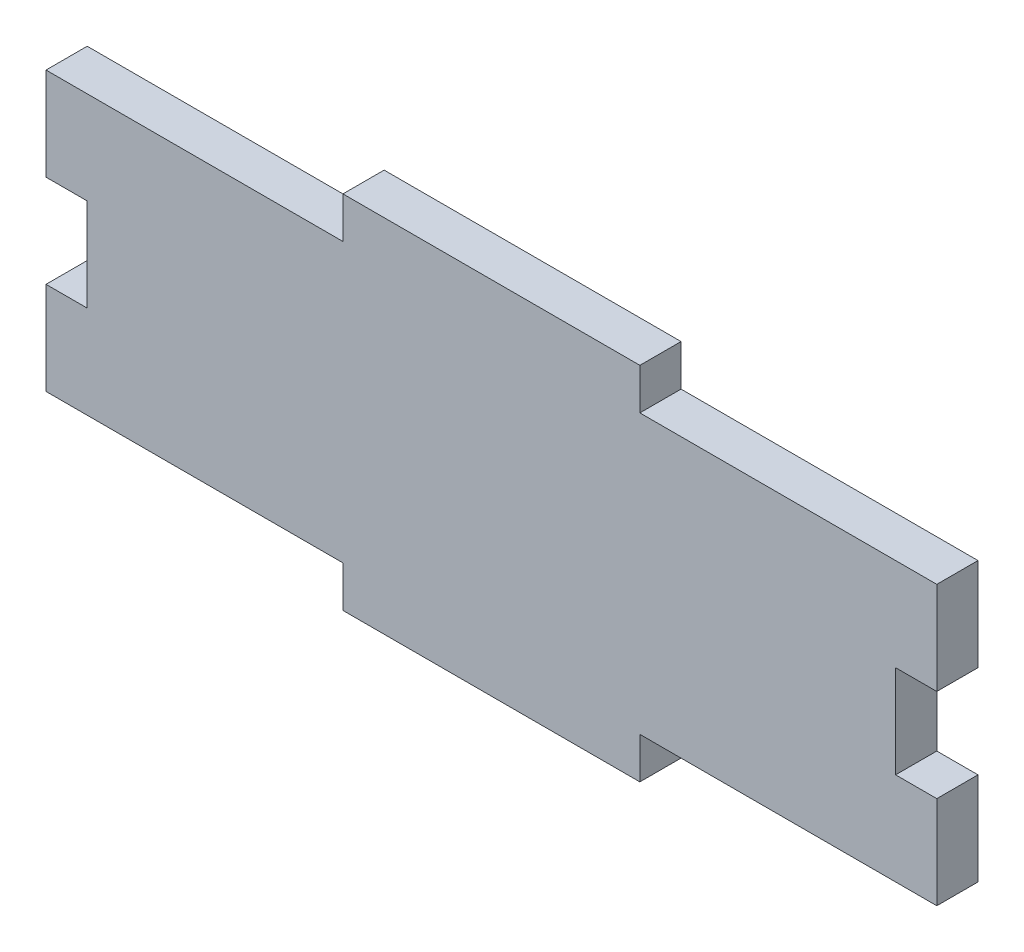
ISO-10303-21;
HEADER;
FILE_DESCRIPTION(('STEP AP214'),'2;1');
FILE_NAME('part.step','',(''),(''),'','','');
FILE_SCHEMA(('AUTOMOTIVE_DESIGN { 1 0 10303 214 1 1 1 1 }'));
ENDSEC;
DATA;
#1=APPLICATION_CONTEXT('core data for automotive mechanical design processes');
#2=APPLICATION_PROTOCOL_DEFINITION('international standard','automotive_design',2000,#1);
#3=PRODUCT_CONTEXT('',#1,'mechanical');
#4=PRODUCT('Part','Part','',(#3));
#5=PRODUCT_RELATED_PRODUCT_CATEGORY('part','',(#4));
#6=PRODUCT_DEFINITION_FORMATION('','',#4);
#7=PRODUCT_DEFINITION_CONTEXT('part definition',#1,'design');
#8=PRODUCT_DEFINITION('design','',#6,#7);
#9=PRODUCT_DEFINITION_SHAPE('','',#8);
#10=(LENGTH_UNIT() NAMED_UNIT(*) SI_UNIT(.MILLI.,.METRE.));
#11=(NAMED_UNIT(*) PLANE_ANGLE_UNIT() SI_UNIT($,.RADIAN.));
#12=(NAMED_UNIT(*) SI_UNIT($,.STERADIAN.) SOLID_ANGLE_UNIT());
#13=UNCERTAINTY_MEASURE_WITH_UNIT(LENGTH_MEASURE(1.E-05),#10,'distance_accuracy_value','');
#14=(GEOMETRIC_REPRESENTATION_CONTEXT(3) GLOBAL_UNCERTAINTY_ASSIGNED_CONTEXT((#13)) GLOBAL_UNIT_ASSIGNED_CONTEXT((#10,
#11,#12)) REPRESENTATION_CONTEXT('',''));
#15=CARTESIAN_POINT('',(0.,0.,0.));
#16=DIRECTION('',(0.,0.,1.));
#17=DIRECTION('',(1.,0.,0.));
#18=AXIS2_PLACEMENT_3D('',#15,#16,#17);
#19=CARTESIAN_POINT('',(0.,0.,4.699));
#20=DIRECTION('',(0.,0.,-1.));
#21=DIRECTION('',(-1.,0.,0.));
#22=AXIS2_PLACEMENT_3D('',#19,#20,#21);
#23=PLANE('',#22);
#24=DIRECTION('',(-1.,0.,0.));
#25=VECTOR('',#24,1.);
#26=CARTESIAN_POINT('',(101.6,21.1666666666667,4.69900000000004));
#27=LINE('',#26,#25);
#28=CARTESIAN_POINT('',(101.6,21.1666666666667,4.69900000000004));
#29=VERTEX_POINT('',#28);
#30=CARTESIAN_POINT('',(96.901,21.1666666666667,4.69900000000004));
#31=VERTEX_POINT('',#30);
#32=EDGE_CURVE('E182',#29,#31,#27,.T.);
#33=ORIENTED_EDGE('',*,*,#32,.F.);
#34=DIRECTION('',(0.,1.,0.));
#35=VECTOR('',#34,1.);
#36=CARTESIAN_POINT('',(101.6,0.,4.699));
#37=LINE('',#36,#35);
#38=CARTESIAN_POINT('',(101.6,31.75,4.699));
#39=VERTEX_POINT('',#38);
#40=EDGE_CURVE('E190',#29,#39,#37,.T.);
#41=ORIENTED_EDGE('',*,*,#40,.T.);
#42=DIRECTION('',(-1.,0.,0.));
#43=VECTOR('',#42,1.);
#44=CARTESIAN_POINT('',(67.7333333333333,31.75,4.699));
#45=LINE('',#44,#43);
#46=CARTESIAN_POINT('',(67.7333333333333,31.75,4.699));
#47=VERTEX_POINT('',#46);
#48=EDGE_CURVE('E299',#39,#47,#45,.T.);
#49=ORIENTED_EDGE('',*,*,#48,.T.);
#50=DIRECTION('',(0.,1.,0.));
#51=VECTOR('',#50,1.);
#52=CARTESIAN_POINT('',(67.7333333333333,31.75,4.699));
#53=LINE('',#52,#51);
#54=CARTESIAN_POINT('',(67.7333333333333,36.449,4.699));
#55=VERTEX_POINT('',#54);
#56=EDGE_CURVE('E301',#47,#55,#53,.T.);
#57=ORIENTED_EDGE('',*,*,#56,.T.);
#58=DIRECTION('',(-1.,0.,0.));
#59=VECTOR('',#58,1.);
#60=CARTESIAN_POINT('',(33.8666666666667,36.449,4.699));
#61=LINE('',#60,#59);
#62=CARTESIAN_POINT('',(33.8666666666667,36.449,4.699));
#63=VERTEX_POINT('',#62);
#64=EDGE_CURVE('E307',#55,#63,#61,.T.);
#65=ORIENTED_EDGE('',*,*,#64,.T.);
#66=DIRECTION('',(0.,-1.,0.));
#67=VECTOR('',#66,1.);
#68=CARTESIAN_POINT('',(33.8666666666667,31.75,4.699));
#69=LINE('',#68,#67);
#70=CARTESIAN_POINT('',(33.8666666666667,31.75,4.699));
#71=VERTEX_POINT('',#70);
#72=EDGE_CURVE('E309',#63,#71,#69,.T.);
#73=ORIENTED_EDGE('',*,*,#72,.T.);
#74=DIRECTION('',(-1.,0.,0.));
#75=VECTOR('',#74,1.);
#76=CARTESIAN_POINT('',(0.,31.75,4.699));
#77=LINE('',#76,#75);
#78=CARTESIAN_POINT('',(0.,31.75,4.699));
#79=VERTEX_POINT('',#78);
#80=EDGE_CURVE('E220',#71,#79,#77,.T.);
#81=ORIENTED_EDGE('',*,*,#80,.T.);
#82=DIRECTION('',(0.,-1.,0.));
#83=VECTOR('',#82,1.);
#84=CARTESIAN_POINT('',(0.,0.,4.699));
#85=LINE('',#84,#83);
#86=CARTESIAN_POINT('',(0.,21.1666666666667,4.69900000000001));
#87=VERTEX_POINT('',#86);
#88=EDGE_CURVE('E315',#79,#87,#85,.T.);
#89=ORIENTED_EDGE('',*,*,#88,.T.);
#90=DIRECTION('',(-1.,0.,0.));
#91=VECTOR('',#90,1.);
#92=CARTESIAN_POINT('',(4.699,21.1666666666667,4.69900000000001));
#93=LINE('',#92,#91);
#94=CARTESIAN_POINT('',(4.699,21.1666666666667,4.69900000000001));
#95=VERTEX_POINT('',#94);
#96=EDGE_CURVE('E485',#95,#87,#93,.T.);
#97=ORIENTED_EDGE('',*,*,#96,.F.);
#98=DIRECTION('',(0.,-1.,0.));
#99=VECTOR('',#98,1.);
#100=CARTESIAN_POINT('',(4.699,10.5833333333334,4.69900000000001));
#101=LINE('',#100,#99);
#102=CARTESIAN_POINT('',(4.699,10.5833333333334,4.69900000000001));
#103=VERTEX_POINT('',#102);
#104=EDGE_CURVE('E474',#95,#103,#101,.T.);
#105=ORIENTED_EDGE('',*,*,#104,.T.);
#106=DIRECTION('',(-1.,0.,0.));
#107=VECTOR('',#106,1.);
#108=CARTESIAN_POINT('',(4.699,10.5833333333334,4.69900000000001));
#109=LINE('',#108,#107);
#110=CARTESIAN_POINT('',(0.,10.5833333333334,4.69900000000001));
#111=VERTEX_POINT('',#110);
#112=EDGE_CURVE('E483',#103,#111,#109,.T.);
#113=ORIENTED_EDGE('',*,*,#112,.T.);
#114=CARTESIAN_POINT('',(0.,0.,4.699));
#115=VERTEX_POINT('',#114);
#116=EDGE_CURVE('E215',#111,#115,#85,.T.);
#117=ORIENTED_EDGE('',*,*,#116,.T.);
#118=DIRECTION('',(1.,0.,0.));
#119=VECTOR('',#118,1.);
#120=CARTESIAN_POINT('',(0.,0.,4.699));
#121=LINE('',#120,#119);
#122=CARTESIAN_POINT('',(33.8666666666667,0.,4.699));
#123=VERTEX_POINT('',#122);
#124=EDGE_CURVE('E256',#115,#123,#121,.T.);
#125=ORIENTED_EDGE('',*,*,#124,.T.);
#126=DIRECTION('',(0.,-1.,0.));
#127=VECTOR('',#126,1.);
#128=CARTESIAN_POINT('',(33.8666666666667,0.,4.699));
#129=LINE('',#128,#127);
#130=CARTESIAN_POINT('',(33.8666666666667,-4.699,4.699));
#131=VERTEX_POINT('',#130);
#132=EDGE_CURVE('E326',#123,#131,#129,.T.);
#133=ORIENTED_EDGE('',*,*,#132,.T.);
#134=DIRECTION('',(1.,0.,0.));
#135=VECTOR('',#134,1.);
#136=CARTESIAN_POINT('',(33.8666666666667,-4.699,4.699));
#137=LINE('',#136,#135);
#138=CARTESIAN_POINT('',(67.7333333333333,-4.699,4.699));
#139=VERTEX_POINT('',#138);
#140=EDGE_CURVE('E332',#131,#139,#137,.T.);
#141=ORIENTED_EDGE('',*,*,#140,.T.);
#142=DIRECTION('',(0.,1.,0.));
#143=VECTOR('',#142,1.);
#144=CARTESIAN_POINT('',(67.7333333333333,0.,4.699));
#145=LINE('',#144,#143);
#146=CARTESIAN_POINT('',(67.7333333333333,0.,4.699));
#147=VERTEX_POINT('',#146);
#148=EDGE_CURVE('E333',#139,#147,#145,.T.);
#149=ORIENTED_EDGE('',*,*,#148,.T.);
#150=DIRECTION('',(1.,0.,0.));
#151=VECTOR('',#150,1.);
#152=CARTESIAN_POINT('',(67.7333333333333,0.,4.699));
#153=LINE('',#152,#151);
#154=CARTESIAN_POINT('',(101.6,0.,4.699));
#155=VERTEX_POINT('',#154);
#156=EDGE_CURVE('E288',#147,#155,#153,.T.);
#157=ORIENTED_EDGE('',*,*,#156,.T.);
#158=CARTESIAN_POINT('',(101.6,10.5833333333334,4.699));
#159=VERTEX_POINT('',#158);
#160=EDGE_CURVE('E297',#155,#159,#37,.T.);
#161=ORIENTED_EDGE('',*,*,#160,.T.);
#162=DIRECTION('',(-1.,0.,0.));
#163=VECTOR('',#162,1.);
#164=CARTESIAN_POINT('',(101.6,10.5833333333334,4.69900000000004));
#165=LINE('',#164,#163);
#166=CARTESIAN_POINT('',(96.901,10.5833333333334,4.69900000000004));
#167=VERTEX_POINT('',#166);
#168=EDGE_CURVE('E48',#159,#167,#165,.T.);
#169=ORIENTED_EDGE('',*,*,#168,.T.);
#170=DIRECTION('',(0.,-1.,0.));
#171=VECTOR('',#170,1.);
#172=CARTESIAN_POINT('',(96.901,10.5833333333334,4.69900000000004));
#173=LINE('',#172,#171);
#174=EDGE_CURVE('E497',#31,#167,#173,.T.);
#175=ORIENTED_EDGE('',*,*,#174,.F.);
#176=EDGE_LOOP('',(#33,#41,#49,#57,#65,#73,#81,#89,#97,#105,#113,#117,#125,#133,#141,#149,#157,
#161,#169,#175));
#177=FACE_BOUND('',#176,.T.);
#178=ADVANCED_FACE('F33',(#177),#23,.F.);
#179=CARTESIAN_POINT('',(101.6,0.,4.699));
#180=DIRECTION('',(-1.,0.,0.));
#181=DIRECTION('',(0.,0.,1.));
#182=AXIS2_PLACEMENT_3D('',#179,#180,#181);
#183=PLANE('',#182);
#184=DIRECTION('',(0.,0.,1.));
#185=VECTOR('',#184,1.);
#186=CARTESIAN_POINT('',(101.6,21.1666666666667,0.));
#187=LINE('',#186,#185);
#188=CARTESIAN_POINT('',(101.6,21.1666666666667,0.));
#189=VERTEX_POINT('',#188);
#190=EDGE_CURVE('E175',#189,#29,#187,.T.);
#191=ORIENTED_EDGE('',*,*,#190,.F.);
#192=DIRECTION('',(0.,1.,0.));
#193=VECTOR('',#192,1.);
#194=CARTESIAN_POINT('',(101.6,0.,0.));
#195=LINE('',#194,#193);
#196=CARTESIAN_POINT('',(101.6,31.75,0.));
#197=VERTEX_POINT('',#196);
#198=EDGE_CURVE('E188',#189,#197,#195,.T.);
#199=ORIENTED_EDGE('',*,*,#198,.T.);
#200=DIRECTION('',(0.,0.,-1.));
#201=VECTOR('',#200,1.);
#202=CARTESIAN_POINT('',(101.6,31.75,4.699));
#203=LINE('',#202,#201);
#204=EDGE_CURVE('E232',#39,#197,#203,.T.);
#205=ORIENTED_EDGE('',*,*,#204,.F.);
#206=ORIENTED_EDGE('',*,*,#40,.F.);
#207=EDGE_LOOP('',(#191,#199,#205,#206));
#208=FACE_BOUND('',#207,.T.);
#209=ADVANCED_FACE('F186',(#208),#183,.F.);
#210=DIRECTION('',(0.,0.,-1.));
#211=VECTOR('',#210,1.);
#212=CARTESIAN_POINT('',(101.6,10.5833333333334,0.));
#213=LINE('',#212,#211);
#214=CARTESIAN_POINT('',(101.6,10.5833333333334,0.));
#215=VERTEX_POINT('',#214);
#216=EDGE_CURVE('E191',#159,#215,#213,.T.);
#217=ORIENTED_EDGE('',*,*,#216,.F.);
#218=ORIENTED_EDGE('',*,*,#160,.F.);
#219=DIRECTION('',(0.,0.,-1.));
#220=VECTOR('',#219,1.);
#221=CARTESIAN_POINT('',(101.6,0.,4.699));
#222=LINE('',#221,#220);
#223=CARTESIAN_POINT('',(101.6,0.,0.));
#224=VERTEX_POINT('',#223);
#225=EDGE_CURVE('E234',#155,#224,#222,.T.);
#226=ORIENTED_EDGE('',*,*,#225,.T.);
#227=EDGE_CURVE('E198',#224,#215,#195,.T.);
#228=ORIENTED_EDGE('',*,*,#227,.T.);
#229=EDGE_LOOP('',(#217,#218,#226,#228));
#230=FACE_BOUND('',#229,.T.);
#231=ADVANCED_FACE('F294',(#230),#183,.F.);
#232=CARTESIAN_POINT('',(0.,0.,4.699));
#233=DIRECTION('',(1.,0.,0.));
#234=DIRECTION('',(0.,0.,-1.));
#235=AXIS2_PLACEMENT_3D('',#232,#233,#234);
#236=PLANE('',#235);
#237=DIRECTION('',(0.,0.,1.));
#238=VECTOR('',#237,1.);
#239=CARTESIAN_POINT('',(0.,21.1666666666667,0.));
#240=LINE('',#239,#238);
#241=CARTESIAN_POINT('',(0.,21.1666666666667,0.));
#242=VERTEX_POINT('',#241);
#243=EDGE_CURVE('E324',#242,#87,#240,.T.);
#244=ORIENTED_EDGE('',*,*,#243,.T.);
#245=ORIENTED_EDGE('',*,*,#88,.F.);
#246=DIRECTION('',(0.,0.,-1.));
#247=VECTOR('',#246,1.);
#248=CARTESIAN_POINT('',(0.,31.75,4.699));
#249=LINE('',#248,#247);
#250=CARTESIAN_POINT('',(0.,31.75,0.));
#251=VERTEX_POINT('',#250);
#252=EDGE_CURVE('E216',#79,#251,#249,.T.);
#253=ORIENTED_EDGE('',*,*,#252,.T.);
#254=DIRECTION('',(0.,-1.,0.));
#255=VECTOR('',#254,1.);
#256=CARTESIAN_POINT('',(0.,0.,0.));
#257=LINE('',#256,#255);
#258=EDGE_CURVE('E265',#251,#242,#257,.T.);
#259=ORIENTED_EDGE('',*,*,#258,.T.);
#260=EDGE_LOOP('',(#244,#245,#253,#259));
#261=FACE_BOUND('',#260,.T.);
#262=ADVANCED_FACE('F35',(#261),#236,.F.);
#263=DIRECTION('',(0.,0.,-1.));
#264=VECTOR('',#263,1.);
#265=CARTESIAN_POINT('',(0.,10.5833333333334,0.));
#266=LINE('',#265,#264);
#267=CARTESIAN_POINT('',(0.,10.5833333333334,0.));
#268=VERTEX_POINT('',#267);
#269=EDGE_CURVE('E263',#111,#268,#266,.T.);
#270=ORIENTED_EDGE('',*,*,#269,.T.);
#271=CARTESIAN_POINT('',(0.,0.,0.));
#272=VERTEX_POINT('',#271);
#273=EDGE_CURVE('E262',#268,#272,#257,.T.);
#274=ORIENTED_EDGE('',*,*,#273,.T.);
#275=DIRECTION('',(0.,0.,-1.));
#276=VECTOR('',#275,1.);
#277=CARTESIAN_POINT('',(0.,0.,4.699));
#278=LINE('',#277,#276);
#279=EDGE_CURVE('E41',#115,#272,#278,.T.);
#280=ORIENTED_EDGE('',*,*,#279,.F.);
#281=ORIENTED_EDGE('',*,*,#116,.F.);
#282=EDGE_LOOP('',(#270,#274,#280,#281));
#283=FACE_BOUND('',#282,.T.);
#284=ADVANCED_FACE('F260',(#283),#236,.F.);
#285=CARTESIAN_POINT('',(0.,0.,0.));
#286=DIRECTION('',(0.,0.,-1.));
#287=DIRECTION('',(-1.,0.,0.));
#288=AXIS2_PLACEMENT_3D('',#285,#286,#287);
#289=PLANE('',#288);
#290=DIRECTION('',(0.,1.,0.));
#291=VECTOR('',#290,1.);
#292=CARTESIAN_POINT('',(96.901,0.,0.));
#293=LINE('',#292,#291);
#294=CARTESIAN_POINT('',(96.901,10.5833333333334,0.));
#295=VERTEX_POINT('',#294);
#296=CARTESIAN_POINT('',(96.901,21.1666666666667,0.));
#297=VERTEX_POINT('',#296);
#298=EDGE_CURVE('E181',#295,#297,#293,.T.);
#299=ORIENTED_EDGE('',*,*,#298,.F.);
#300=DIRECTION('',(-1.,0.,0.));
#301=VECTOR('',#300,1.);
#302=CARTESIAN_POINT('',(101.6,10.5833333333334,0.));
#303=LINE('',#302,#301);
#304=EDGE_CURVE('E292',#215,#295,#303,.T.);
#305=ORIENTED_EDGE('',*,*,#304,.F.);
#306=ORIENTED_EDGE('',*,*,#227,.F.);
#307=DIRECTION('',(1.,0.,0.));
#308=VECTOR('',#307,1.);
#309=CARTESIAN_POINT('',(67.7333333333333,0.,0.));
#310=LINE('',#309,#308);
#311=CARTESIAN_POINT('',(67.7333333333333,0.,0.));
#312=VERTEX_POINT('',#311);
#313=EDGE_CURVE('E199',#312,#224,#310,.T.);
#314=ORIENTED_EDGE('',*,*,#313,.F.);
#315=DIRECTION('',(0.,1.,0.));
#316=VECTOR('',#315,1.);
#317=CARTESIAN_POINT('',(67.7333333333333,0.,0.));
#318=LINE('',#317,#316);
#319=CARTESIAN_POINT('',(67.7333333333333,-4.699,0.));
#320=VERTEX_POINT('',#319);
#321=EDGE_CURVE('E202',#320,#312,#318,.T.);
#322=ORIENTED_EDGE('',*,*,#321,.F.);
#323=DIRECTION('',(1.,0.,0.));
#324=VECTOR('',#323,1.);
#325=CARTESIAN_POINT('',(33.8666666666667,-4.699,0.));
#326=LINE('',#325,#324);
#327=CARTESIAN_POINT('',(33.8666666666667,-4.699,0.));
#328=VERTEX_POINT('',#327);
#329=EDGE_CURVE('E272',#328,#320,#326,.T.);
#330=ORIENTED_EDGE('',*,*,#329,.F.);
#331=DIRECTION('',(0.,-1.,0.));
#332=VECTOR('',#331,1.);
#333=CARTESIAN_POINT('',(33.8666666666667,0.,0.));
#334=LINE('',#333,#332);
#335=CARTESIAN_POINT('',(33.8666666666667,0.,0.));
#336=VERTEX_POINT('',#335);
#337=EDGE_CURVE('E270',#336,#328,#334,.T.);
#338=ORIENTED_EDGE('',*,*,#337,.F.);
#339=DIRECTION('',(1.,0.,0.));
#340=VECTOR('',#339,1.);
#341=CARTESIAN_POINT('',(0.,0.,0.));
#342=LINE('',#341,#340);
#343=EDGE_CURVE('E255',#272,#336,#342,.T.);
#344=ORIENTED_EDGE('',*,*,#343,.F.);
#345=ORIENTED_EDGE('',*,*,#273,.F.);
#346=DIRECTION('',(-1.,0.,0.));
#347=VECTOR('',#346,1.);
#348=CARTESIAN_POINT('',(4.699,10.5833333333334,0.));
#349=LINE('',#348,#347);
#350=CARTESIAN_POINT('',(4.699,10.5833333333334,0.));
#351=VERTEX_POINT('',#350);
#352=EDGE_CURVE('E479',#351,#268,#349,.T.);
#353=ORIENTED_EDGE('',*,*,#352,.F.);
#354=DIRECTION('',(0.,1.,0.));
#355=VECTOR('',#354,1.);
#356=CARTESIAN_POINT('',(4.699,0.,0.));
#357=LINE('',#356,#355);
#358=CARTESIAN_POINT('',(4.699,21.1666666666667,0.));
#359=VERTEX_POINT('',#358);
#360=EDGE_CURVE('E11',#351,#359,#357,.T.);
#361=ORIENTED_EDGE('',*,*,#360,.T.);
#362=DIRECTION('',(-1.,0.,0.));
#363=VECTOR('',#362,1.);
#364=CARTESIAN_POINT('',(4.699,21.1666666666667,0.));
#365=LINE('',#364,#363);
#366=EDGE_CURVE('E266',#359,#242,#365,.T.);
#367=ORIENTED_EDGE('',*,*,#366,.T.);
#368=ORIENTED_EDGE('',*,*,#258,.F.);
#369=DIRECTION('',(-1.,0.,0.));
#370=VECTOR('',#369,1.);
#371=CARTESIAN_POINT('',(0.,31.75,0.));
#372=LINE('',#371,#370);
#373=CARTESIAN_POINT('',(33.8666666666667,31.75,0.));
#374=VERTEX_POINT('',#373);
#375=EDGE_CURVE('E213',#374,#251,#372,.T.);
#376=ORIENTED_EDGE('',*,*,#375,.F.);
#377=DIRECTION('',(0.,-1.,0.));
#378=VECTOR('',#377,1.);
#379=CARTESIAN_POINT('',(33.8666666666667,31.75,0.));
#380=LINE('',#379,#378);
#381=CARTESIAN_POINT('',(33.8666666666667,36.449,0.));
#382=VERTEX_POINT('',#381);
#383=EDGE_CURVE('E211',#382,#374,#380,.T.);
#384=ORIENTED_EDGE('',*,*,#383,.F.);
#385=DIRECTION('',(-1.,0.,0.));
#386=VECTOR('',#385,1.);
#387=CARTESIAN_POINT('',(33.8666666666667,36.449,0.));
#388=LINE('',#387,#386);
#389=CARTESIAN_POINT('',(67.7333333333333,36.449,0.));
#390=VERTEX_POINT('',#389);
#391=EDGE_CURVE('E209',#390,#382,#388,.T.);
#392=ORIENTED_EDGE('',*,*,#391,.F.);
#393=DIRECTION('',(0.,1.,0.));
#394=VECTOR('',#393,1.);
#395=CARTESIAN_POINT('',(67.7333333333333,31.75,0.));
#396=LINE('',#395,#394);
#397=CARTESIAN_POINT('',(67.7333333333333,31.75,0.));
#398=VERTEX_POINT('',#397);
#399=EDGE_CURVE('E207',#398,#390,#396,.T.);
#400=ORIENTED_EDGE('',*,*,#399,.F.);
#401=DIRECTION('',(-1.,0.,0.));
#402=VECTOR('',#401,1.);
#403=CARTESIAN_POINT('',(67.7333333333333,31.75,0.));
#404=LINE('',#403,#402);
#405=EDGE_CURVE('E197',#197,#398,#404,.T.);
#406=ORIENTED_EDGE('',*,*,#405,.F.);
#407=ORIENTED_EDGE('',*,*,#198,.F.);
#408=DIRECTION('',(-1.,0.,0.));
#409=VECTOR('',#408,1.);
#410=CARTESIAN_POINT('',(101.6,21.1666666666667,0.));
#411=LINE('',#410,#409);
#412=EDGE_CURVE('E171',#189,#297,#411,.T.);
#413=ORIENTED_EDGE('',*,*,#412,.T.);
#414=EDGE_LOOP('',(#299,#305,#306,#314,#322,#330,#338,#344,#345,#353,#361,#367,#368,#376,#384,
#392,#400,#406,#407,#413));
#415=FACE_BOUND('',#414,.T.);
#416=ADVANCED_FACE('F195',(#415),#289,.T.);
#417=CARTESIAN_POINT('',(0.,0.,4.699));
#418=DIRECTION('',(0.,1.,0.));
#419=DIRECTION('',(0.,0.,1.));
#420=AXIS2_PLACEMENT_3D('',#417,#418,#419);
#421=PLANE('',#420);
#422=ORIENTED_EDGE('',*,*,#343,.T.);
#423=DIRECTION('',(0.,0.,-1.));
#424=VECTOR('',#423,1.);
#425=CARTESIAN_POINT('',(33.8666666666667,0.,4.699));
#426=LINE('',#425,#424);
#427=EDGE_CURVE('E246',#123,#336,#426,.T.);
#428=ORIENTED_EDGE('',*,*,#427,.F.);
#429=ORIENTED_EDGE('',*,*,#124,.F.);
#430=ORIENTED_EDGE('',*,*,#279,.T.);
#431=EDGE_LOOP('',(#422,#428,#429,#430));
#432=FACE_BOUND('',#431,.T.);
#433=ADVANCED_FACE('F252',(#432),#421,.F.);
#434=CARTESIAN_POINT('',(33.8666666666667,0.,4.699));
#435=DIRECTION('',(1.,0.,0.));
#436=DIRECTION('',(0.,0.,-1.));
#437=AXIS2_PLACEMENT_3D('',#434,#435,#436);
#438=PLANE('',#437);
#439=ORIENTED_EDGE('',*,*,#337,.T.);
#440=DIRECTION('',(0.,0.,-1.));
#441=VECTOR('',#440,1.);
#442=CARTESIAN_POINT('',(33.8666666666667,-4.699,4.699));
#443=LINE('',#442,#441);
#444=EDGE_CURVE('E243',#131,#328,#443,.T.);
#445=ORIENTED_EDGE('',*,*,#444,.F.);
#446=ORIENTED_EDGE('',*,*,#132,.F.);
#447=ORIENTED_EDGE('',*,*,#427,.T.);
#448=EDGE_LOOP('',(#439,#445,#446,#447));
#449=FACE_BOUND('',#448,.T.);
#450=ADVANCED_FACE('F340',(#449),#438,.F.);
#451=CARTESIAN_POINT('',(33.8666666666667,-4.699,4.699));
#452=DIRECTION('',(0.,1.,0.));
#453=DIRECTION('',(0.,0.,1.));
#454=AXIS2_PLACEMENT_3D('',#451,#452,#453);
#455=PLANE('',#454);
#456=ORIENTED_EDGE('',*,*,#329,.T.);
#457=DIRECTION('',(0.,0.,-1.));
#458=VECTOR('',#457,1.);
#459=CARTESIAN_POINT('',(67.7333333333333,-4.699,4.699));
#460=LINE('',#459,#458);
#461=EDGE_CURVE('E240',#139,#320,#460,.T.);
#462=ORIENTED_EDGE('',*,*,#461,.F.);
#463=ORIENTED_EDGE('',*,*,#140,.F.);
#464=ORIENTED_EDGE('',*,*,#444,.T.);
#465=EDGE_LOOP('',(#456,#462,#463,#464));
#466=FACE_BOUND('',#465,.T.);
#467=ADVANCED_FACE('F338',(#466),#455,.F.);
#468=CARTESIAN_POINT('',(67.7333333333333,0.,4.699));
#469=DIRECTION('',(-1.,0.,0.));
#470=DIRECTION('',(0.,0.,1.));
#471=AXIS2_PLACEMENT_3D('',#468,#469,#470);
#472=PLANE('',#471);
#473=ORIENTED_EDGE('',*,*,#321,.T.);
#474=DIRECTION('',(0.,0.,-1.));
#475=VECTOR('',#474,1.);
#476=CARTESIAN_POINT('',(67.7333333333333,0.,4.699));
#477=LINE('',#476,#475);
#478=EDGE_CURVE('E237',#147,#312,#477,.T.);
#479=ORIENTED_EDGE('',*,*,#478,.F.);
#480=ORIENTED_EDGE('',*,*,#148,.F.);
#481=ORIENTED_EDGE('',*,*,#461,.T.);
#482=EDGE_LOOP('',(#473,#479,#480,#481));
#483=FACE_BOUND('',#482,.T.);
#484=ADVANCED_FACE('F280',(#483),#472,.F.);
#485=CARTESIAN_POINT('',(67.7333333333333,0.,4.699));
#486=DIRECTION('',(0.,1.,0.));
#487=DIRECTION('',(0.,0.,1.));
#488=AXIS2_PLACEMENT_3D('',#485,#486,#487);
#489=PLANE('',#488);
#490=ORIENTED_EDGE('',*,*,#313,.T.);
#491=ORIENTED_EDGE('',*,*,#225,.F.);
#492=ORIENTED_EDGE('',*,*,#156,.F.);
#493=ORIENTED_EDGE('',*,*,#478,.T.);
#494=EDGE_LOOP('',(#490,#491,#492,#493));
#495=FACE_BOUND('',#494,.T.);
#496=ADVANCED_FACE('F286',(#495),#489,.F.);
#497=CARTESIAN_POINT('',(67.7333333333333,31.75,4.699));
#498=DIRECTION('',(0.,-1.,0.));
#499=DIRECTION('',(0.,0.,-1.));
#500=AXIS2_PLACEMENT_3D('',#497,#498,#499);
#501=PLANE('',#500);
#502=ORIENTED_EDGE('',*,*,#405,.T.);
#503=DIRECTION('',(0.,0.,-1.));
#504=VECTOR('',#503,1.);
#505=CARTESIAN_POINT('',(67.7333333333333,31.75,4.699));
#506=LINE('',#505,#504);
#507=EDGE_CURVE('E229',#47,#398,#506,.T.);
#508=ORIENTED_EDGE('',*,*,#507,.F.);
#509=ORIENTED_EDGE('',*,*,#48,.F.);
#510=ORIENTED_EDGE('',*,*,#204,.T.);
#511=EDGE_LOOP('',(#502,#508,#509,#510));
#512=FACE_BOUND('',#511,.T.);
#513=ADVANCED_FACE('F374',(#512),#501,.F.);
#514=CARTESIAN_POINT('',(67.7333333333333,31.75,4.699));
#515=DIRECTION('',(-1.,0.,0.));
#516=DIRECTION('',(0.,0.,1.));
#517=AXIS2_PLACEMENT_3D('',#514,#515,#516);
#518=PLANE('',#517);
#519=ORIENTED_EDGE('',*,*,#399,.T.);
#520=DIRECTION('',(0.,0.,-1.));
#521=VECTOR('',#520,1.);
#522=CARTESIAN_POINT('',(67.7333333333333,36.449,4.699));
#523=LINE('',#522,#521);
#524=EDGE_CURVE('E226',#55,#390,#523,.T.);
#525=ORIENTED_EDGE('',*,*,#524,.F.);
#526=ORIENTED_EDGE('',*,*,#56,.F.);
#527=ORIENTED_EDGE('',*,*,#507,.T.);
#528=EDGE_LOOP('',(#519,#525,#526,#527));
#529=FACE_BOUND('',#528,.T.);
#530=ADVANCED_FACE('F370',(#529),#518,.F.);
#531=CARTESIAN_POINT('',(33.8666666666667,36.449,4.699));
#532=DIRECTION('',(0.,-1.,0.));
#533=DIRECTION('',(0.,0.,-1.));
#534=AXIS2_PLACEMENT_3D('',#531,#532,#533);
#535=PLANE('',#534);
#536=ORIENTED_EDGE('',*,*,#391,.T.);
#537=DIRECTION('',(0.,0.,-1.));
#538=VECTOR('',#537,1.);
#539=CARTESIAN_POINT('',(33.8666666666667,36.449,4.699));
#540=LINE('',#539,#538);
#541=EDGE_CURVE('E223',#63,#382,#540,.T.);
#542=ORIENTED_EDGE('',*,*,#541,.F.);
#543=ORIENTED_EDGE('',*,*,#64,.F.);
#544=ORIENTED_EDGE('',*,*,#524,.T.);
#545=EDGE_LOOP('',(#536,#542,#543,#544));
#546=FACE_BOUND('',#545,.T.);
#547=ADVANCED_FACE('F366',(#546),#535,.F.);
#548=CARTESIAN_POINT('',(33.8666666666667,31.75,4.699));
#549=DIRECTION('',(1.,0.,0.));
#550=DIRECTION('',(0.,0.,-1.));
#551=AXIS2_PLACEMENT_3D('',#548,#549,#550);
#552=PLANE('',#551);
#553=ORIENTED_EDGE('',*,*,#383,.T.);
#554=DIRECTION('',(0.,0.,-1.));
#555=VECTOR('',#554,1.);
#556=CARTESIAN_POINT('',(33.8666666666667,31.75,4.699));
#557=LINE('',#556,#555);
#558=EDGE_CURVE('E219',#71,#374,#557,.T.);
#559=ORIENTED_EDGE('',*,*,#558,.F.);
#560=ORIENTED_EDGE('',*,*,#72,.F.);
#561=ORIENTED_EDGE('',*,*,#541,.T.);
#562=EDGE_LOOP('',(#553,#559,#560,#561));
#563=FACE_BOUND('',#562,.T.);
#564=ADVANCED_FACE('F363',(#563),#552,.F.);
#565=CARTESIAN_POINT('',(0.,31.75,4.699));
#566=DIRECTION('',(0.,-1.,0.));
#567=DIRECTION('',(0.,0.,-1.));
#568=AXIS2_PLACEMENT_3D('',#565,#566,#567);
#569=PLANE('',#568);
#570=ORIENTED_EDGE('',*,*,#375,.T.);
#571=ORIENTED_EDGE('',*,*,#252,.F.);
#572=ORIENTED_EDGE('',*,*,#80,.F.);
#573=ORIENTED_EDGE('',*,*,#558,.T.);
#574=EDGE_LOOP('',(#570,#571,#572,#573));
#575=FACE_BOUND('',#574,.T.);
#576=ADVANCED_FACE('F319',(#575),#569,.F.);
#577=CARTESIAN_POINT('',(4.699,21.1666666666667,0.));
#578=DIRECTION('',(0.,-1.,0.));
#579=DIRECTION('',(0.,0.,-1.));
#580=AXIS2_PLACEMENT_3D('',#577,#578,#579);
#581=PLANE('',#580);
#582=ORIENTED_EDGE('',*,*,#243,.F.);
#583=ORIENTED_EDGE('',*,*,#366,.F.);
#584=DIRECTION('',(0.,0.,1.));
#585=VECTOR('',#584,1.);
#586=CARTESIAN_POINT('',(4.699,21.1666666666667,0.));
#587=LINE('',#586,#585);
#588=EDGE_CURVE('E56',#359,#95,#587,.T.);
#589=ORIENTED_EDGE('',*,*,#588,.T.);
#590=ORIENTED_EDGE('',*,*,#96,.T.);
#591=EDGE_LOOP('',(#582,#583,#589,#590));
#592=FACE_BOUND('',#591,.T.);
#593=ADVANCED_FACE('F357',(#592),#581,.T.);
#594=CARTESIAN_POINT('',(4.699,10.5833333333334,0.));
#595=DIRECTION('',(0.,1.,0.));
#596=DIRECTION('',(-1.,0.,0.));
#597=AXIS2_PLACEMENT_3D('',#594,#595,#596);
#598=PLANE('',#597);
#599=ORIENTED_EDGE('',*,*,#269,.F.);
#600=ORIENTED_EDGE('',*,*,#112,.F.);
#601=DIRECTION('',(0.,0.,-1.));
#602=VECTOR('',#601,1.);
#603=CARTESIAN_POINT('',(4.699,10.5833333333334,0.));
#604=LINE('',#603,#602);
#605=EDGE_CURVE('E477',#103,#351,#604,.T.);
#606=ORIENTED_EDGE('',*,*,#605,.T.);
#607=ORIENTED_EDGE('',*,*,#352,.T.);
#608=EDGE_LOOP('',(#599,#600,#606,#607));
#609=FACE_BOUND('',#608,.T.);
#610=ADVANCED_FACE('F420',(#609),#598,.T.);
#611=CARTESIAN_POINT('',(4.699,31.75,-12.7));
#612=DIRECTION('',(-1.,0.,0.));
#613=DIRECTION('',(0.,0.,-1.));
#614=AXIS2_PLACEMENT_3D('',#611,#612,#613);
#615=PLANE('',#614);
#616=ORIENTED_EDGE('',*,*,#605,.F.);
#617=ORIENTED_EDGE('',*,*,#104,.F.);
#618=ORIENTED_EDGE('',*,*,#588,.F.);
#619=ORIENTED_EDGE('',*,*,#360,.F.);
#620=EDGE_LOOP('',(#616,#617,#618,#619));
#621=FACE_BOUND('',#620,.T.);
#622=ADVANCED_FACE('F429',(#621),#615,.T.);
#623=CARTESIAN_POINT('',(101.6,21.1666666666667,0.));
#624=DIRECTION('',(0.,-1.,0.));
#625=DIRECTION('',(0.,0.,-1.));
#626=AXIS2_PLACEMENT_3D('',#623,#624,#625);
#627=PLANE('',#626);
#628=DIRECTION('',(0.,0.,1.));
#629=VECTOR('',#628,1.);
#630=CARTESIAN_POINT('',(96.901,21.1666666666667,0.));
#631=LINE('',#630,#629);
#632=EDGE_CURVE('E177',#297,#31,#631,.T.);
#633=ORIENTED_EDGE('',*,*,#632,.F.);
#634=ORIENTED_EDGE('',*,*,#412,.F.);
#635=ORIENTED_EDGE('',*,*,#190,.T.);
#636=ORIENTED_EDGE('',*,*,#32,.T.);
#637=EDGE_LOOP('',(#633,#634,#635,#636));
#638=FACE_BOUND('',#637,.T.);
#639=ADVANCED_FACE('F173',(#638),#627,.T.);
#640=CARTESIAN_POINT('',(101.6,10.5833333333334,0.));
#641=DIRECTION('',(0.,1.,0.));
#642=DIRECTION('',(-1.,0.,0.));
#643=AXIS2_PLACEMENT_3D('',#640,#641,#642);
#644=PLANE('',#643);
#645=DIRECTION('',(0.,0.,-1.));
#646=VECTOR('',#645,1.);
#647=CARTESIAN_POINT('',(96.901,10.5833333333334,0.));
#648=LINE('',#647,#646);
#649=EDGE_CURVE('E192',#167,#295,#648,.T.);
#650=ORIENTED_EDGE('',*,*,#649,.F.);
#651=ORIENTED_EDGE('',*,*,#168,.F.);
#652=ORIENTED_EDGE('',*,*,#216,.T.);
#653=ORIENTED_EDGE('',*,*,#304,.T.);
#654=EDGE_LOOP('',(#650,#651,#652,#653));
#655=FACE_BOUND('',#654,.T.);
#656=ADVANCED_FACE('F444',(#655),#644,.T.);
#657=CARTESIAN_POINT('',(96.901,31.75,-12.7));
#658=DIRECTION('',(-1.,0.,0.));
#659=DIRECTION('',(0.,0.,-1.));
#660=AXIS2_PLACEMENT_3D('',#657,#658,#659);
#661=PLANE('',#660);
#662=ORIENTED_EDGE('',*,*,#298,.T.);
#663=ORIENTED_EDGE('',*,*,#632,.T.);
#664=ORIENTED_EDGE('',*,*,#174,.T.);
#665=ORIENTED_EDGE('',*,*,#649,.T.);
#666=EDGE_LOOP('',(#662,#663,#664,#665));
#667=FACE_BOUND('',#666,.T.);
#668=ADVANCED_FACE('F452',(#667),#661,.F.);
#669=CLOSED_SHELL('',(#178,#209,#231,#262,#284,#416,#433,#450,#467,#484,#496,#513,#530,#547,
#564,#576,#593,#610,#622,#639,#656,#668));
#670=MANIFOLD_SOLID_BREP('B2',#669);
#671=ADVANCED_BREP_SHAPE_REPRESENTATION('',(#18,#670),#14);
#672=SHAPE_DEFINITION_REPRESENTATION(#9,#671);
ENDSEC;
END-ISO-10303-21;
